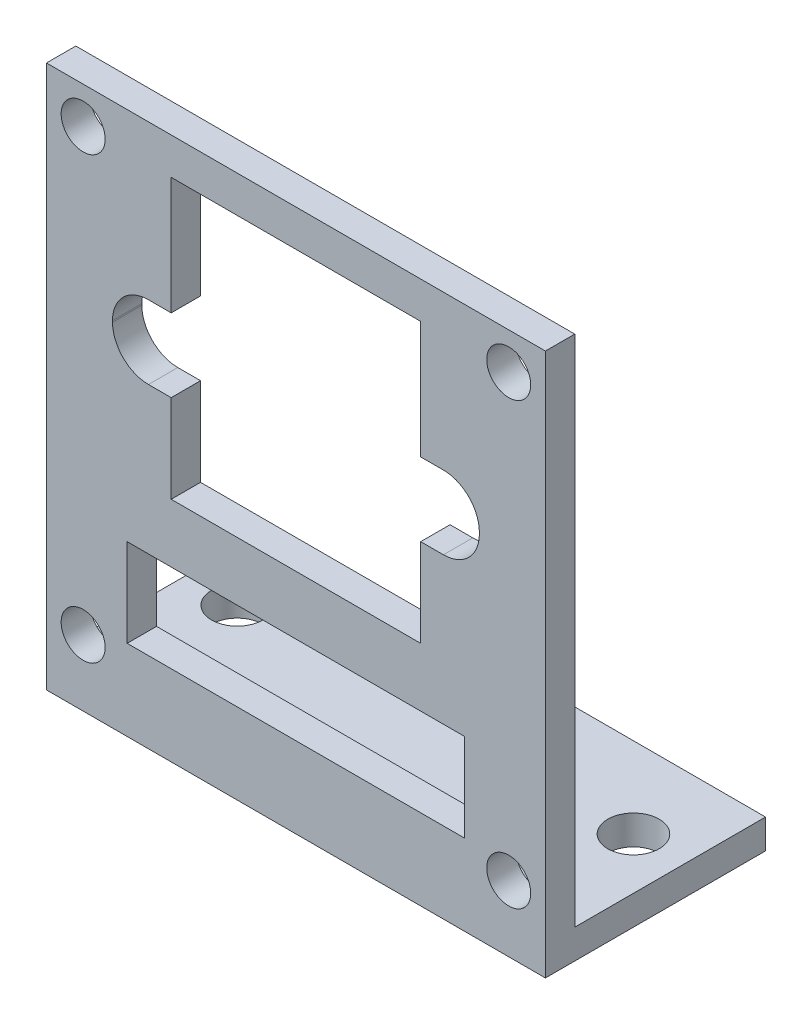
ISO-10303-21;
HEADER;
FILE_DESCRIPTION(('STEP AP214'),'2;1');
FILE_NAME('part.step','',(''),(''),'','','');
FILE_SCHEMA(('AUTOMOTIVE_DESIGN { 1 0 10303 214 1 1 1 1 }'));
ENDSEC;
DATA;
#1=APPLICATION_CONTEXT('core data for automotive mechanical design processes');
#2=APPLICATION_PROTOCOL_DEFINITION('international standard','automotive_design',2000,#1);
#3=PRODUCT_CONTEXT('',#1,'mechanical');
#4=PRODUCT('Part','Part','',(#3));
#5=PRODUCT_RELATED_PRODUCT_CATEGORY('part','',(#4));
#6=PRODUCT_DEFINITION_FORMATION('','',#4);
#7=PRODUCT_DEFINITION_CONTEXT('part definition',#1,'design');
#8=PRODUCT_DEFINITION('design','',#6,#7);
#9=PRODUCT_DEFINITION_SHAPE('','',#8);
#10=(LENGTH_UNIT() NAMED_UNIT(*) SI_UNIT(.MILLI.,.METRE.));
#11=(NAMED_UNIT(*) PLANE_ANGLE_UNIT() SI_UNIT($,.RADIAN.));
#12=(NAMED_UNIT(*) SI_UNIT($,.STERADIAN.) SOLID_ANGLE_UNIT());
#13=UNCERTAINTY_MEASURE_WITH_UNIT(LENGTH_MEASURE(1.E-05),#10,'distance_accuracy_value','');
#14=(GEOMETRIC_REPRESENTATION_CONTEXT(3) GLOBAL_UNCERTAINTY_ASSIGNED_CONTEXT((#13)) GLOBAL_UNIT_ASSIGNED_CONTEXT((#10,
#11,#12)) REPRESENTATION_CONTEXT('',''));
#15=CARTESIAN_POINT('',(0.,0.,0.));
#16=DIRECTION('',(0.,0.,1.));
#17=DIRECTION('',(1.,0.,0.));
#18=AXIS2_PLACEMENT_3D('',#15,#16,#17);
#19=CARTESIAN_POINT('',(0.,0.,2.));
#20=DIRECTION('',(0.,0.,1.));
#21=DIRECTION('',(1.,0.,0.));
#22=AXIS2_PLACEMENT_3D('',#19,#20,#21);
#23=PLANE('',#22);
#24=CARTESIAN_POINT('',(-19.8102928728624,-18.1706781534091,2.));
#25=DIRECTION('',(0.,0.,1.));
#26=DIRECTION('',(1.,0.,0.));
#27=AXIS2_PLACEMENT_3D('',#24,#25,#26);
#28=CIRCLE('',#27,1.5);
#29=CARTESIAN_POINT('',(-18.3102928728624,-18.1706781534091,2.));
#30=VERTEX_POINT('',#29);
#31=EDGE_CURVE('E432',#30,#30,#28,.T.);
#32=ORIENTED_EDGE('',*,*,#31,.F.);
#33=EDGE_LOOP('',(#32));
#34=FACE_BOUND('',#33,.T.);
#35=DIRECTION('',(1.,0.,0.));
#36=VECTOR('',#35,1.);
#37=CARTESIAN_POINT('',(-16.8102928728627,-17.1706781534091,2.));
#38=LINE('',#37,#36);
#39=CARTESIAN_POINT('',(-16.8102928728627,-17.1706781534091,2.));
#40=VERTEX_POINT('',#39);
#41=CARTESIAN_POINT('',(6.18970712713729,-17.1706781534091,2.));
#42=VERTEX_POINT('',#41);
#43=EDGE_CURVE('E451',#40,#42,#38,.T.);
#44=ORIENTED_EDGE('',*,*,#43,.F.);
#45=DIRECTION('',(0.,-1.,0.));
#46=VECTOR('',#45,1.);
#47=CARTESIAN_POINT('',(-16.8102928728627,-11.1706781534091,2.));
#48=LINE('',#47,#46);
#49=CARTESIAN_POINT('',(-16.8102928728627,-11.1706781534091,2.));
#50=VERTEX_POINT('',#49);
#51=EDGE_CURVE('E448',#50,#40,#48,.T.);
#52=ORIENTED_EDGE('',*,*,#51,.F.);
#53=DIRECTION('',(-1.,0.,0.));
#54=VECTOR('',#53,1.);
#55=CARTESIAN_POINT('',(-16.8102928728627,-11.1706781534091,2.));
#56=LINE('',#55,#54);
#57=CARTESIAN_POINT('',(6.18970712713729,-11.1706781534091,2.));
#58=VERTEX_POINT('',#57);
#59=EDGE_CURVE('E459',#58,#50,#56,.T.);
#60=ORIENTED_EDGE('',*,*,#59,.F.);
#61=DIRECTION('',(0.,1.,0.));
#62=VECTOR('',#61,1.);
#63=CARTESIAN_POINT('',(6.18970712713729,-11.1706781534091,2.));
#64=LINE('',#63,#62);
#65=EDGE_CURVE('E455',#42,#58,#64,.T.);
#66=ORIENTED_EDGE('',*,*,#65,.F.);
#67=EDGE_LOOP('',(#44,#52,#60,#66));
#68=FACE_BOUND('',#67,.T.);
#69=CARTESIAN_POINT('',(-19.8102928728627,11.8293218465909,2.));
#70=DIRECTION('',(0.,0.,1.));
#71=DIRECTION('',(1.,0.,0.));
#72=AXIS2_PLACEMENT_3D('',#69,#70,#71);
#73=CIRCLE('',#72,1.5);
#74=CARTESIAN_POINT('',(-18.3102928728627,11.8293218465909,2.));
#75=VERTEX_POINT('',#74);
#76=EDGE_CURVE('E491',#75,#75,#73,.T.);
#77=ORIENTED_EDGE('',*,*,#76,.F.);
#78=EDGE_LOOP('',(#77));
#79=FACE_BOUND('',#78,.T.);
#80=DIRECTION('',(0.,-1.,0.));
#81=VECTOR('',#80,1.);
#82=CARTESIAN_POINT('',(-22.3102928728627,14.3293218465909,2.));
#83=LINE('',#82,#81);
#84=CARTESIAN_POINT('',(-22.3102928728627,14.3293218465909,2.));
#85=VERTEX_POINT('',#84);
#86=CARTESIAN_POINT('',(-22.3102928728627,-22.6706781534091,2.));
#87=VERTEX_POINT('',#86);
#88=EDGE_CURVE('E499',#85,#87,#83,.T.);
#89=ORIENTED_EDGE('',*,*,#88,.T.);
#90=DIRECTION('',(1.,0.,0.));
#91=VECTOR('',#90,1.);
#92=CARTESIAN_POINT('',(-22.3102928728627,-22.6706781534091,2.));
#93=LINE('',#92,#91);
#94=CARTESIAN_POINT('',(11.6897071271373,-22.6706781534091,2.));
#95=VERTEX_POINT('',#94);
#96=EDGE_CURVE('E224',#87,#95,#93,.T.);
#97=ORIENTED_EDGE('',*,*,#96,.T.);
#98=DIRECTION('',(0.,1.,0.));
#99=VECTOR('',#98,1.);
#100=CARTESIAN_POINT('',(11.6897071271373,14.3293218465909,2.));
#101=LINE('',#100,#99);
#102=CARTESIAN_POINT('',(11.6897071271373,14.3293218465909,2.));
#103=VERTEX_POINT('',#102);
#104=EDGE_CURVE('E502',#95,#103,#101,.T.);
#105=ORIENTED_EDGE('',*,*,#104,.T.);
#106=DIRECTION('',(-1.,0.,0.));
#107=VECTOR('',#106,1.);
#108=CARTESIAN_POINT('',(-22.3102928728627,14.3293218465909,2.));
#109=LINE('',#108,#107);
#110=EDGE_CURVE('E506',#103,#85,#109,.T.);
#111=ORIENTED_EDGE('',*,*,#110,.T.);
#112=EDGE_LOOP('',(#89,#97,#105,#111));
#113=FACE_BOUND('',#112,.T.);
#114=CARTESIAN_POINT('',(9.18970712713729,11.8293218465909,2.));
#115=DIRECTION('',(0.,0.,1.));
#116=DIRECTION('',(1.,0.,0.));
#117=AXIS2_PLACEMENT_3D('',#114,#115,#116);
#118=CIRCLE('',#117,1.5);
#119=CARTESIAN_POINT('',(10.6897071271373,11.8293218465909,2.));
#120=VERTEX_POINT('',#119);
#121=EDGE_CURVE('E440',#120,#120,#118,.T.);
#122=ORIENTED_EDGE('',*,*,#121,.F.);
#123=EDGE_LOOP('',(#122));
#124=FACE_BOUND('',#123,.T.);
#125=CARTESIAN_POINT('',(9.1897071271376,-18.1706781534091,2.));
#126=DIRECTION('',(0.,0.,1.));
#127=DIRECTION('',(1.,0.,0.));
#128=AXIS2_PLACEMENT_3D('',#125,#126,#127);
#129=CIRCLE('',#128,1.5);
#130=CARTESIAN_POINT('',(10.6897071271376,-18.1706781534091,2.));
#131=VERTEX_POINT('',#130);
#132=EDGE_CURVE('E424',#131,#131,#129,.T.);
#133=ORIENTED_EDGE('',*,*,#132,.F.);
#134=EDGE_LOOP('',(#133));
#135=FACE_BOUND('',#134,.T.);
#136=DIRECTION('',(-1.,0.,0.));
#137=VECTOR('',#136,1.);
#138=CARTESIAN_POINT('',(-13.8102928728627,3.82932184659091,2.));
#139=LINE('',#138,#137);
#140=CARTESIAN_POINT('',(-13.8102928728627,3.82932184659091,2.));
#141=VERTEX_POINT('',#140);
#142=CARTESIAN_POINT('',(-15.3602928728627,3.82932184659091,2.));
#143=VERTEX_POINT('',#142);
#144=EDGE_CURVE('E269',#141,#143,#139,.T.);
#145=ORIENTED_EDGE('',*,*,#144,.F.);
#146=DIRECTION('',(0.,-1.,0.));
#147=VECTOR('',#146,1.);
#148=CARTESIAN_POINT('',(-13.8102928728627,11.8293218465909,2.));
#149=LINE('',#148,#147);
#150=CARTESIAN_POINT('',(-13.8102928728627,11.8293218465909,2.));
#151=VERTEX_POINT('',#150);
#152=EDGE_CURVE('E266',#151,#141,#149,.T.);
#153=ORIENTED_EDGE('',*,*,#152,.F.);
#154=DIRECTION('',(-1.,0.,0.));
#155=VECTOR('',#154,1.);
#156=CARTESIAN_POINT('',(-13.8102928728627,11.8293218465909,2.));
#157=LINE('',#156,#155);
#158=CARTESIAN_POINT('',(3.1897071271373,11.8293218465909,2.));
#159=VERTEX_POINT('',#158);
#160=EDGE_CURVE('E312',#159,#151,#157,.T.);
#161=ORIENTED_EDGE('',*,*,#160,.F.);
#162=DIRECTION('',(0.,1.,0.));
#163=VECTOR('',#162,1.);
#164=CARTESIAN_POINT('',(3.1897071271373,11.8293218465909,2.));
#165=LINE('',#164,#163);
#166=CARTESIAN_POINT('',(3.1897071271373,3.82932184659091,2.));
#167=VERTEX_POINT('',#166);
#168=EDGE_CURVE('E309',#167,#159,#165,.T.);
#169=ORIENTED_EDGE('',*,*,#168,.F.);
#170=DIRECTION('',(-1.,0.,0.));
#171=VECTOR('',#170,1.);
#172=CARTESIAN_POINT('',(3.1897071271373,3.82932184659091,2.));
#173=LINE('',#172,#171);
#174=CARTESIAN_POINT('',(4.73970712713728,3.82932184659091,2.));
#175=VERTEX_POINT('',#174);
#176=EDGE_CURVE('E306',#175,#167,#173,.T.);
#177=ORIENTED_EDGE('',*,*,#176,.F.);
#178=CARTESIAN_POINT('',(4.7397071271373,1.37932184659091,2.));
#179=DIRECTION('',(0.,0.,1.));
#180=DIRECTION('',(-1.,0.,0.));
#181=AXIS2_PLACEMENT_3D('',#178,#179,#180);
#182=CIRCLE('',#181,2.45);
#183=CARTESIAN_POINT('',(7.1897071271373,1.37932184659089,2.));
#184=VERTEX_POINT('',#183);
#185=EDGE_CURVE('E303',#184,#175,#182,.T.);
#186=ORIENTED_EDGE('',*,*,#185,.F.);
#187=DIRECTION('',(0.,1.,0.));
#188=VECTOR('',#187,1.);
#189=CARTESIAN_POINT('',(7.1897071271373,1.37932184659089,2.));
#190=LINE('',#189,#188);
#191=CARTESIAN_POINT('',(7.1897071271373,1.27932184659093,2.));
#192=VERTEX_POINT('',#191);
#193=EDGE_CURVE('E300',#192,#184,#190,.T.);
#194=ORIENTED_EDGE('',*,*,#193,.F.);
#195=CARTESIAN_POINT('',(4.7397071271373,1.27932184659091,2.));
#196=DIRECTION('',(0.,0.,1.));
#197=DIRECTION('',(1.,0.,0.));
#198=AXIS2_PLACEMENT_3D('',#195,#196,#197);
#199=CIRCLE('',#198,2.45);
#200=CARTESIAN_POINT('',(4.73970712713728,-1.17067815340909,2.));
#201=VERTEX_POINT('',#200);
#202=EDGE_CURVE('E297',#201,#192,#199,.T.);
#203=ORIENTED_EDGE('',*,*,#202,.F.);
#204=DIRECTION('',(1.,0.,0.));
#205=VECTOR('',#204,1.);
#206=CARTESIAN_POINT('',(3.1897071271373,-1.17067815340909,2.));
#207=LINE('',#206,#205);
#208=CARTESIAN_POINT('',(3.1897071271373,-1.17067815340909,2.));
#209=VERTEX_POINT('',#208);
#210=EDGE_CURVE('E294',#209,#201,#207,.T.);
#211=ORIENTED_EDGE('',*,*,#210,.F.);
#212=DIRECTION('',(0.,1.,0.));
#213=VECTOR('',#212,1.);
#214=CARTESIAN_POINT('',(3.1897071271373,-1.17067815340909,2.));
#215=LINE('',#214,#213);
#216=CARTESIAN_POINT('',(3.1897071271373,-7.17067815340909,2.));
#217=VERTEX_POINT('',#216);
#218=EDGE_CURVE('E291',#217,#209,#215,.T.);
#219=ORIENTED_EDGE('',*,*,#218,.F.);
#220=DIRECTION('',(1.,0.,0.));
#221=VECTOR('',#220,1.);
#222=CARTESIAN_POINT('',(-13.8102928728627,-7.17067815340909,2.));
#223=LINE('',#222,#221);
#224=CARTESIAN_POINT('',(-13.8102928728627,-7.17067815340909,2.));
#225=VERTEX_POINT('',#224);
#226=EDGE_CURVE('E288',#225,#217,#223,.T.);
#227=ORIENTED_EDGE('',*,*,#226,.F.);
#228=DIRECTION('',(0.,-1.,0.));
#229=VECTOR('',#228,1.);
#230=CARTESIAN_POINT('',(-13.8102928728627,-1.17067815340909,2.));
#231=LINE('',#230,#229);
#232=CARTESIAN_POINT('',(-13.8102928728627,-1.17067815340909,2.));
#233=VERTEX_POINT('',#232);
#234=EDGE_CURVE('E285',#233,#225,#231,.T.);
#235=ORIENTED_EDGE('',*,*,#234,.F.);
#236=DIRECTION('',(1.,0.,0.));
#237=VECTOR('',#236,1.);
#238=CARTESIAN_POINT('',(-13.8102928728627,-1.17067815340909,2.));
#239=LINE('',#238,#237);
#240=CARTESIAN_POINT('',(-15.3602928728627,-1.17067815340909,2.));
#241=VERTEX_POINT('',#240);
#242=EDGE_CURVE('E282',#241,#233,#239,.T.);
#243=ORIENTED_EDGE('',*,*,#242,.F.);
#244=CARTESIAN_POINT('',(-15.3602928728627,1.27932184659091,2.));
#245=DIRECTION('',(0.,0.,1.));
#246=DIRECTION('',(-1.,0.,0.));
#247=AXIS2_PLACEMENT_3D('',#244,#245,#246);
#248=CIRCLE('',#247,2.45);
#249=CARTESIAN_POINT('',(-17.8102928728627,1.27932184659091,2.));
#250=VERTEX_POINT('',#249);
#251=EDGE_CURVE('E279',#250,#241,#248,.T.);
#252=ORIENTED_EDGE('',*,*,#251,.F.);
#253=DIRECTION('',(0.,-1.,0.));
#254=VECTOR('',#253,1.);
#255=CARTESIAN_POINT('',(-17.8102928728627,1.3793218465909,2.));
#256=LINE('',#255,#254);
#257=CARTESIAN_POINT('',(-17.8102928728627,1.3793218465909,2.));
#258=VERTEX_POINT('',#257);
#259=EDGE_CURVE('E276',#258,#250,#256,.T.);
#260=ORIENTED_EDGE('',*,*,#259,.F.);
#261=CARTESIAN_POINT('',(-15.3602928728627,1.37932184659091,2.));
#262=DIRECTION('',(0.,0.,1.));
#263=DIRECTION('',(1.,0.,0.));
#264=AXIS2_PLACEMENT_3D('',#261,#262,#263);
#265=CIRCLE('',#264,2.45);
#266=EDGE_CURVE('E273',#143,#258,#265,.T.);
#267=ORIENTED_EDGE('',*,*,#266,.F.);
#268=EDGE_LOOP('',(#145,#153,#161,#169,#177,#186,#194,#203,#211,#219,#227,#235,#243,#252,#260,#267));
#269=FACE_BOUND('',#268,.T.);
#270=ADVANCED_FACE('F39',(#34,#68,#79,#113,#124,#135,#269),#23,.T.);
#271=CARTESIAN_POINT('',(0.,0.,0.));
#272=DIRECTION('',(0.,0.,1.));
#273=DIRECTION('',(1.,0.,0.));
#274=AXIS2_PLACEMENT_3D('',#271,#272,#273);
#275=PLANE('',#274);
#276=CARTESIAN_POINT('',(9.1897071271376,-18.1706781534091,0.));
#277=DIRECTION('',(0.,0.,1.));
#278=DIRECTION('',(1.,0.,0.));
#279=AXIS2_PLACEMENT_3D('',#276,#277,#278);
#280=CIRCLE('',#279,1.5);
#281=CARTESIAN_POINT('',(10.6897071271376,-18.1706781534091,0.));
#282=VERTEX_POINT('',#281);
#283=EDGE_CURVE('E423',#282,#282,#280,.T.);
#284=ORIENTED_EDGE('',*,*,#283,.T.);
#285=EDGE_LOOP('',(#284));
#286=FACE_BOUND('',#285,.T.);
#287=CARTESIAN_POINT('',(-19.8102928728624,-18.1706781534091,0.));
#288=DIRECTION('',(0.,0.,1.));
#289=DIRECTION('',(1.,0.,0.));
#290=AXIS2_PLACEMENT_3D('',#287,#288,#289);
#291=CIRCLE('',#290,1.5);
#292=CARTESIAN_POINT('',(-18.3102928728624,-18.1706781534091,0.));
#293=VERTEX_POINT('',#292);
#294=EDGE_CURVE('E428',#293,#293,#291,.T.);
#295=ORIENTED_EDGE('',*,*,#294,.T.);
#296=EDGE_LOOP('',(#295));
#297=FACE_BOUND('',#296,.T.);
#298=CARTESIAN_POINT('',(9.18970712713729,11.8293218465909,0.));
#299=DIRECTION('',(0.,0.,1.));
#300=DIRECTION('',(1.,0.,0.));
#301=AXIS2_PLACEMENT_3D('',#298,#299,#300);
#302=CIRCLE('',#301,1.5);
#303=CARTESIAN_POINT('',(10.6897071271373,11.8293218465909,0.));
#304=VERTEX_POINT('',#303);
#305=EDGE_CURVE('E436',#304,#304,#302,.T.);
#306=ORIENTED_EDGE('',*,*,#305,.T.);
#307=EDGE_LOOP('',(#306));
#308=FACE_BOUND('',#307,.T.);
#309=DIRECTION('',(0.,-1.,0.));
#310=VECTOR('',#309,1.);
#311=CARTESIAN_POINT('',(-16.8102928728627,-11.1706781534091,0.));
#312=LINE('',#311,#310);
#313=CARTESIAN_POINT('',(-16.8102928728627,-11.1706781534091,0.));
#314=VERTEX_POINT('',#313);
#315=CARTESIAN_POINT('',(-16.8102928728627,-17.1706781534091,0.));
#316=VERTEX_POINT('',#315);
#317=EDGE_CURVE('E444',#314,#316,#312,.T.);
#318=ORIENTED_EDGE('',*,*,#317,.T.);
#319=DIRECTION('',(1.,0.,0.));
#320=VECTOR('',#319,1.);
#321=CARTESIAN_POINT('',(-16.8102928728627,-17.1706781534091,0.));
#322=LINE('',#321,#320);
#323=CARTESIAN_POINT('',(6.18970712713729,-17.1706781534091,0.));
#324=VERTEX_POINT('',#323);
#325=EDGE_CURVE('E466',#316,#324,#322,.T.);
#326=ORIENTED_EDGE('',*,*,#325,.T.);
#327=DIRECTION('',(0.,1.,0.));
#328=VECTOR('',#327,1.);
#329=CARTESIAN_POINT('',(6.18970712713729,-11.1706781534091,0.));
#330=LINE('',#329,#328);
#331=CARTESIAN_POINT('',(6.18970712713729,-11.1706781534091,0.));
#332=VERTEX_POINT('',#331);
#333=EDGE_CURVE('E470',#324,#332,#330,.T.);
#334=ORIENTED_EDGE('',*,*,#333,.T.);
#335=DIRECTION('',(-1.,0.,0.));
#336=VECTOR('',#335,1.);
#337=CARTESIAN_POINT('',(-16.8102928728627,-11.1706781534091,0.));
#338=LINE('',#337,#336);
#339=EDGE_CURVE('E452',#332,#314,#338,.T.);
#340=ORIENTED_EDGE('',*,*,#339,.T.);
#341=EDGE_LOOP('',(#318,#326,#334,#340));
#342=FACE_BOUND('',#341,.T.);
#343=DIRECTION('',(0.,-1.,0.));
#344=VECTOR('',#343,1.);
#345=CARTESIAN_POINT('',(-22.3102928728627,14.3293218465909,0.));
#346=LINE('',#345,#344);
#347=CARTESIAN_POINT('',(-22.3102928728627,14.3293218465909,0.));
#348=VERTEX_POINT('',#347);
#349=CARTESIAN_POINT('',(-22.3102928728627,-20.6706781534091,0.));
#350=VERTEX_POINT('',#349);
#351=EDGE_CURVE('E495',#348,#350,#346,.T.);
#352=ORIENTED_EDGE('',*,*,#351,.F.);
#353=DIRECTION('',(-1.,0.,0.));
#354=VECTOR('',#353,1.);
#355=CARTESIAN_POINT('',(-22.3102928728627,14.3293218465909,0.));
#356=LINE('',#355,#354);
#357=CARTESIAN_POINT('',(11.6897071271373,14.3293218465909,0.));
#358=VERTEX_POINT('',#357);
#359=EDGE_CURVE('E503',#358,#348,#356,.T.);
#360=ORIENTED_EDGE('',*,*,#359,.F.);
#361=DIRECTION('',(0.,1.,0.));
#362=VECTOR('',#361,1.);
#363=CARTESIAN_POINT('',(11.6897071271373,14.3293218465909,0.));
#364=LINE('',#363,#362);
#365=CARTESIAN_POINT('',(11.6897071271373,-20.6706781534091,0.));
#366=VERTEX_POINT('',#365);
#367=EDGE_CURVE('E515',#366,#358,#364,.T.);
#368=ORIENTED_EDGE('',*,*,#367,.F.);
#369=DIRECTION('',(1.,0.,0.));
#370=VECTOR('',#369,1.);
#371=CARTESIAN_POINT('',(-22.3102928728627,-20.6706781534091,0.));
#372=LINE('',#371,#370);
#373=EDGE_CURVE('E511',#350,#366,#372,.T.);
#374=ORIENTED_EDGE('',*,*,#373,.F.);
#375=EDGE_LOOP('',(#352,#360,#368,#374));
#376=FACE_BOUND('',#375,.T.);
#377=CARTESIAN_POINT('',(-19.8102928728627,11.8293218465909,0.));
#378=DIRECTION('',(0.,0.,1.));
#379=DIRECTION('',(1.,0.,0.));
#380=AXIS2_PLACEMENT_3D('',#377,#378,#379);
#381=CIRCLE('',#380,1.5);
#382=CARTESIAN_POINT('',(-18.3102928728627,11.8293218465909,0.));
#383=VERTEX_POINT('',#382);
#384=EDGE_CURVE('E490',#383,#383,#381,.T.);
#385=ORIENTED_EDGE('',*,*,#384,.T.);
#386=EDGE_LOOP('',(#385));
#387=FACE_BOUND('',#386,.T.);
#388=DIRECTION('',(0.,-1.,0.));
#389=VECTOR('',#388,1.);
#390=CARTESIAN_POINT('',(-13.8102928728627,11.8293218465909,0.));
#391=LINE('',#390,#389);
#392=CARTESIAN_POINT('',(-13.8102928728627,11.8293218465909,0.));
#393=VERTEX_POINT('',#392);
#394=CARTESIAN_POINT('',(-13.8102928728627,3.82932184659091,0.));
#395=VERTEX_POINT('',#394);
#396=EDGE_CURVE('E65',#393,#395,#391,.T.);
#397=ORIENTED_EDGE('',*,*,#396,.T.);
#398=DIRECTION('',(-1.,0.,0.));
#399=VECTOR('',#398,1.);
#400=CARTESIAN_POINT('',(-13.8102928728627,3.82932184659091,0.));
#401=LINE('',#400,#399);
#402=CARTESIAN_POINT('',(-15.3602928728627,3.82932184659091,0.));
#403=VERTEX_POINT('',#402);
#404=EDGE_CURVE('E318',#395,#403,#401,.T.);
#405=ORIENTED_EDGE('',*,*,#404,.T.);
#406=CARTESIAN_POINT('',(-15.3602928728627,1.37932184659091,0.));
#407=DIRECTION('',(0.,0.,1.));
#408=DIRECTION('',(1.,0.,0.));
#409=AXIS2_PLACEMENT_3D('',#406,#407,#408);
#410=CIRCLE('',#409,2.45);
#411=CARTESIAN_POINT('',(-17.8102928728627,1.3793218465909,0.));
#412=VERTEX_POINT('',#411);
#413=EDGE_CURVE('E322',#403,#412,#410,.T.);
#414=ORIENTED_EDGE('',*,*,#413,.T.);
#415=DIRECTION('',(0.,-1.,0.));
#416=VECTOR('',#415,1.);
#417=CARTESIAN_POINT('',(-17.8102928728627,1.3793218465909,0.));
#418=LINE('',#417,#416);
#419=CARTESIAN_POINT('',(-17.8102928728627,1.27932184659091,0.));
#420=VERTEX_POINT('',#419);
#421=EDGE_CURVE('E326',#412,#420,#418,.T.);
#422=ORIENTED_EDGE('',*,*,#421,.T.);
#423=CARTESIAN_POINT('',(-15.3602928728627,1.27932184659091,0.));
#424=DIRECTION('',(0.,0.,1.));
#425=DIRECTION('',(-1.,0.,0.));
#426=AXIS2_PLACEMENT_3D('',#423,#424,#425);
#427=CIRCLE('',#426,2.45);
#428=CARTESIAN_POINT('',(-15.3602928728627,-1.17067815340909,0.));
#429=VERTEX_POINT('',#428);
#430=EDGE_CURVE('E330',#420,#429,#427,.T.);
#431=ORIENTED_EDGE('',*,*,#430,.T.);
#432=DIRECTION('',(1.,0.,0.));
#433=VECTOR('',#432,1.);
#434=CARTESIAN_POINT('',(-13.8102928728627,-1.17067815340909,0.));
#435=LINE('',#434,#433);
#436=CARTESIAN_POINT('',(-13.8102928728627,-1.17067815340909,0.));
#437=VERTEX_POINT('',#436);
#438=EDGE_CURVE('E334',#429,#437,#435,.T.);
#439=ORIENTED_EDGE('',*,*,#438,.T.);
#440=DIRECTION('',(0.,-1.,0.));
#441=VECTOR('',#440,1.);
#442=CARTESIAN_POINT('',(-13.8102928728627,-1.17067815340909,0.));
#443=LINE('',#442,#441);
#444=CARTESIAN_POINT('',(-13.8102928728627,-7.17067815340909,0.));
#445=VERTEX_POINT('',#444);
#446=EDGE_CURVE('E338',#437,#445,#443,.T.);
#447=ORIENTED_EDGE('',*,*,#446,.T.);
#448=DIRECTION('',(1.,0.,0.));
#449=VECTOR('',#448,1.);
#450=CARTESIAN_POINT('',(-13.8102928728627,-7.17067815340909,0.));
#451=LINE('',#450,#449);
#452=CARTESIAN_POINT('',(3.1897071271373,-7.17067815340909,0.));
#453=VERTEX_POINT('',#452);
#454=EDGE_CURVE('E342',#445,#453,#451,.T.);
#455=ORIENTED_EDGE('',*,*,#454,.T.);
#456=DIRECTION('',(0.,1.,0.));
#457=VECTOR('',#456,1.);
#458=CARTESIAN_POINT('',(3.1897071271373,-1.17067815340909,0.));
#459=LINE('',#458,#457);
#460=CARTESIAN_POINT('',(3.1897071271373,-1.17067815340909,0.));
#461=VERTEX_POINT('',#460);
#462=EDGE_CURVE('E346',#453,#461,#459,.T.);
#463=ORIENTED_EDGE('',*,*,#462,.T.);
#464=DIRECTION('',(1.,0.,0.));
#465=VECTOR('',#464,1.);
#466=CARTESIAN_POINT('',(3.1897071271373,-1.17067815340909,0.));
#467=LINE('',#466,#465);
#468=CARTESIAN_POINT('',(4.73970712713728,-1.17067815340909,0.));
#469=VERTEX_POINT('',#468);
#470=EDGE_CURVE('E350',#461,#469,#467,.T.);
#471=ORIENTED_EDGE('',*,*,#470,.T.);
#472=CARTESIAN_POINT('',(4.7397071271373,1.27932184659091,0.));
#473=DIRECTION('',(0.,0.,1.));
#474=DIRECTION('',(1.,0.,0.));
#475=AXIS2_PLACEMENT_3D('',#472,#473,#474);
#476=CIRCLE('',#475,2.45);
#477=CARTESIAN_POINT('',(7.1897071271373,1.27932184659093,0.));
#478=VERTEX_POINT('',#477);
#479=EDGE_CURVE('E354',#469,#478,#476,.T.);
#480=ORIENTED_EDGE('',*,*,#479,.T.);
#481=DIRECTION('',(0.,1.,0.));
#482=VECTOR('',#481,1.);
#483=CARTESIAN_POINT('',(7.1897071271373,1.37932184659089,0.));
#484=LINE('',#483,#482);
#485=CARTESIAN_POINT('',(7.1897071271373,1.37932184659089,0.));
#486=VERTEX_POINT('',#485);
#487=EDGE_CURVE('E358',#478,#486,#484,.T.);
#488=ORIENTED_EDGE('',*,*,#487,.T.);
#489=CARTESIAN_POINT('',(4.7397071271373,1.37932184659091,0.));
#490=DIRECTION('',(0.,0.,1.));
#491=DIRECTION('',(-1.,0.,0.));
#492=AXIS2_PLACEMENT_3D('',#489,#490,#491);
#493=CIRCLE('',#492,2.45);
#494=CARTESIAN_POINT('',(4.73970712713728,3.82932184659091,0.));
#495=VERTEX_POINT('',#494);
#496=EDGE_CURVE('E362',#486,#495,#493,.T.);
#497=ORIENTED_EDGE('',*,*,#496,.T.);
#498=DIRECTION('',(-1.,0.,0.));
#499=VECTOR('',#498,1.);
#500=CARTESIAN_POINT('',(3.1897071271373,3.82932184659091,0.));
#501=LINE('',#500,#499);
#502=CARTESIAN_POINT('',(3.1897071271373,3.82932184659091,0.));
#503=VERTEX_POINT('',#502);
#504=EDGE_CURVE('E366',#495,#503,#501,.T.);
#505=ORIENTED_EDGE('',*,*,#504,.T.);
#506=DIRECTION('',(0.,1.,0.));
#507=VECTOR('',#506,1.);
#508=CARTESIAN_POINT('',(3.1897071271373,11.8293218465909,0.));
#509=LINE('',#508,#507);
#510=CARTESIAN_POINT('',(3.1897071271373,11.8293218465909,0.));
#511=VERTEX_POINT('',#510);
#512=EDGE_CURVE('E370',#503,#511,#509,.T.);
#513=ORIENTED_EDGE('',*,*,#512,.T.);
#514=DIRECTION('',(-1.,0.,0.));
#515=VECTOR('',#514,1.);
#516=CARTESIAN_POINT('',(-13.8102928728627,11.8293218465909,0.));
#517=LINE('',#516,#515);
#518=EDGE_CURVE('E270',#511,#393,#517,.T.);
#519=ORIENTED_EDGE('',*,*,#518,.T.);
#520=EDGE_LOOP('',(#397,#405,#414,#422,#431,#439,#447,#455,#463,#471,#480,#488,#497,#505,#513,#519));
#521=FACE_BOUND('',#520,.T.);
#522=ADVANCED_FACE('F557',(#286,#297,#308,#342,#376,#387,#521),#275,.F.);
#523=CARTESIAN_POINT('',(-22.3102928728627,14.3293218465909,2.));
#524=DIRECTION('',(1.,0.,0.));
#525=DIRECTION('',(0.,1.,0.));
#526=AXIS2_PLACEMENT_3D('',#523,#524,#525);
#527=PLANE('',#526);
#528=ORIENTED_EDGE('',*,*,#351,.T.);
#529=DIRECTION('',(0.,0.,1.));
#530=VECTOR('',#529,1.);
#531=CARTESIAN_POINT('',(-22.3102928728627,-20.6706781534091,-13.));
#532=LINE('',#531,#530);
#533=CARTESIAN_POINT('',(-22.3102928728627,-20.6706781534091,-13.));
#534=VERTEX_POINT('',#533);
#535=EDGE_CURVE('E245',#534,#350,#532,.T.);
#536=ORIENTED_EDGE('',*,*,#535,.F.);
#537=DIRECTION('',(0.,-1.,0.));
#538=VECTOR('',#537,1.);
#539=CARTESIAN_POINT('',(-22.3102928728627,-20.6706781534091,-13.));
#540=LINE('',#539,#538);
#541=CARTESIAN_POINT('',(-22.3102928728627,-22.6706781534091,-13.));
#542=VERTEX_POINT('',#541);
#543=EDGE_CURVE('E237',#534,#542,#540,.T.);
#544=ORIENTED_EDGE('',*,*,#543,.T.);
#545=DIRECTION('',(0.,0.,1.));
#546=VECTOR('',#545,1.);
#547=CARTESIAN_POINT('',(-22.3102928728627,-22.6706781534091,-13.));
#548=LINE('',#547,#546);
#549=EDGE_CURVE('E218',#542,#87,#548,.T.);
#550=ORIENTED_EDGE('',*,*,#549,.T.);
#551=ORIENTED_EDGE('',*,*,#88,.F.);
#552=DIRECTION('',(0.,0.,-1.));
#553=VECTOR('',#552,1.);
#554=CARTESIAN_POINT('',(-22.3102928728627,14.3293218465909,2.));
#555=LINE('',#554,#553);
#556=EDGE_CURVE('E49',#85,#348,#555,.T.);
#557=ORIENTED_EDGE('',*,*,#556,.T.);
#558=EDGE_LOOP('',(#528,#536,#544,#550,#551,#557));
#559=FACE_BOUND('',#558,.T.);
#560=ADVANCED_FACE('F41',(#559),#527,.F.);
#561=CARTESIAN_POINT('',(11.6897071271373,14.3293218465909,2.));
#562=DIRECTION('',(-1.,0.,0.));
#563=DIRECTION('',(0.,-1.,0.));
#564=AXIS2_PLACEMENT_3D('',#561,#562,#563);
#565=PLANE('',#564);
#566=ORIENTED_EDGE('',*,*,#367,.T.);
#567=DIRECTION('',(0.,0.,-1.));
#568=VECTOR('',#567,1.);
#569=CARTESIAN_POINT('',(11.6897071271373,14.3293218465909,2.));
#570=LINE('',#569,#568);
#571=EDGE_CURVE('E11',#103,#358,#570,.T.);
#572=ORIENTED_EDGE('',*,*,#571,.F.);
#573=ORIENTED_EDGE('',*,*,#104,.F.);
#574=DIRECTION('',(0.,0.,1.));
#575=VECTOR('',#574,1.);
#576=CARTESIAN_POINT('',(11.6897071271373,-22.6706781534091,-13.));
#577=LINE('',#576,#575);
#578=CARTESIAN_POINT('',(11.6897071271373,-22.6706781534091,-13.));
#579=VERTEX_POINT('',#578);
#580=EDGE_CURVE('E229',#579,#95,#577,.T.);
#581=ORIENTED_EDGE('',*,*,#580,.F.);
#582=DIRECTION('',(0.,1.,0.));
#583=VECTOR('',#582,1.);
#584=CARTESIAN_POINT('',(11.6897071271373,-20.6706781534091,-13.));
#585=LINE('',#584,#583);
#586=CARTESIAN_POINT('',(11.6897071271373,-20.6706781534091,-13.));
#587=VERTEX_POINT('',#586);
#588=EDGE_CURVE('E240',#579,#587,#585,.T.);
#589=ORIENTED_EDGE('',*,*,#588,.T.);
#590=DIRECTION('',(0.,0.,1.));
#591=VECTOR('',#590,1.);
#592=CARTESIAN_POINT('',(11.6897071271373,-20.6706781534091,-13.));
#593=LINE('',#592,#591);
#594=EDGE_CURVE('E260',#587,#366,#593,.T.);
#595=ORIENTED_EDGE('',*,*,#594,.T.);
#596=EDGE_LOOP('',(#566,#572,#573,#581,#589,#595));
#597=FACE_BOUND('',#596,.T.);
#598=ADVANCED_FACE('F547',(#597),#565,.F.);
#599=CARTESIAN_POINT('',(-22.3102928728627,14.3293218465909,2.));
#600=DIRECTION('',(0.,-1.,0.));
#601=DIRECTION('',(0.,0.,-1.));
#602=AXIS2_PLACEMENT_3D('',#599,#600,#601);
#603=PLANE('',#602);
#604=ORIENTED_EDGE('',*,*,#359,.T.);
#605=ORIENTED_EDGE('',*,*,#556,.F.);
#606=ORIENTED_EDGE('',*,*,#110,.F.);
#607=ORIENTED_EDGE('',*,*,#571,.T.);
#608=EDGE_LOOP('',(#604,#605,#606,#607));
#609=FACE_BOUND('',#608,.T.);
#610=ADVANCED_FACE('F559',(#609),#603,.F.);
#611=CARTESIAN_POINT('',(-19.8102928728627,11.8293218465909,2.));
#612=DIRECTION('',(0.,0.,-1.));
#613=DIRECTION('',(-1.,0.,0.));
#614=AXIS2_PLACEMENT_3D('',#611,#612,#613);
#615=CYLINDRICAL_SURFACE('',#614,1.5);
#616=ORIENTED_EDGE('',*,*,#76,.T.);
#617=EDGE_LOOP('',(#616));
#618=FACE_BOUND('',#617,.T.);
#619=ORIENTED_EDGE('',*,*,#384,.F.);
#620=EDGE_LOOP('',(#619));
#621=FACE_BOUND('',#620,.T.);
#622=ADVANCED_FACE('F561',(#618,#621),#615,.F.);
#623=CARTESIAN_POINT('',(-16.8102928728627,-11.1706781534091,2.));
#624=DIRECTION('',(1.,0.,0.));
#625=DIRECTION('',(0.,0.,-1.));
#626=AXIS2_PLACEMENT_3D('',#623,#624,#625);
#627=PLANE('',#626);
#628=ORIENTED_EDGE('',*,*,#317,.F.);
#629=DIRECTION('',(0.,0.,-1.));
#630=VECTOR('',#629,1.);
#631=CARTESIAN_POINT('',(-16.8102928728627,-11.1706781534091,2.));
#632=LINE('',#631,#630);
#633=EDGE_CURVE('E462',#50,#314,#632,.T.);
#634=ORIENTED_EDGE('',*,*,#633,.F.);
#635=ORIENTED_EDGE('',*,*,#51,.T.);
#636=DIRECTION('',(0.,0.,-1.));
#637=VECTOR('',#636,1.);
#638=CARTESIAN_POINT('',(-16.8102928728627,-17.1706781534091,2.));
#639=LINE('',#638,#637);
#640=EDGE_CURVE('E486',#40,#316,#639,.T.);
#641=ORIENTED_EDGE('',*,*,#640,.T.);
#642=EDGE_LOOP('',(#628,#634,#635,#641));
#643=FACE_BOUND('',#642,.T.);
#644=ADVANCED_FACE('F567',(#643),#627,.T.);
#645=CARTESIAN_POINT('',(-16.8102928728627,-17.1706781534091,2.));
#646=DIRECTION('',(0.,1.,0.));
#647=DIRECTION('',(0.,0.,1.));
#648=AXIS2_PLACEMENT_3D('',#645,#646,#647);
#649=PLANE('',#648);
#650=ORIENTED_EDGE('',*,*,#325,.F.);
#651=ORIENTED_EDGE('',*,*,#640,.F.);
#652=ORIENTED_EDGE('',*,*,#43,.T.);
#653=DIRECTION('',(0.,0.,-1.));
#654=VECTOR('',#653,1.);
#655=CARTESIAN_POINT('',(6.18970712713729,-17.1706781534091,2.));
#656=LINE('',#655,#654);
#657=EDGE_CURVE('E483',#42,#324,#656,.T.);
#658=ORIENTED_EDGE('',*,*,#657,.T.);
#659=EDGE_LOOP('',(#650,#651,#652,#658));
#660=FACE_BOUND('',#659,.T.);
#661=ADVANCED_FACE('F583',(#660),#649,.T.);
#662=CARTESIAN_POINT('',(6.18970712713729,-11.1706781534091,2.));
#663=DIRECTION('',(-1.,0.,0.));
#664=DIRECTION('',(0.,-1.,0.));
#665=AXIS2_PLACEMENT_3D('',#662,#663,#664);
#666=PLANE('',#665);
#667=ORIENTED_EDGE('',*,*,#333,.F.);
#668=ORIENTED_EDGE('',*,*,#657,.F.);
#669=ORIENTED_EDGE('',*,*,#65,.T.);
#670=DIRECTION('',(0.,0.,-1.));
#671=VECTOR('',#670,1.);
#672=CARTESIAN_POINT('',(6.18970712713729,-11.1706781534091,2.));
#673=LINE('',#672,#671);
#674=EDGE_CURVE('E480',#58,#332,#673,.T.);
#675=ORIENTED_EDGE('',*,*,#674,.T.);
#676=EDGE_LOOP('',(#667,#668,#669,#675));
#677=FACE_BOUND('',#676,.T.);
#678=ADVANCED_FACE('F587',(#677),#666,.T.);
#679=CARTESIAN_POINT('',(-16.8102928728627,-11.1706781534091,2.));
#680=DIRECTION('',(0.,-1.,0.));
#681=DIRECTION('',(0.,0.,-1.));
#682=AXIS2_PLACEMENT_3D('',#679,#680,#681);
#683=PLANE('',#682);
#684=ORIENTED_EDGE('',*,*,#339,.F.);
#685=ORIENTED_EDGE('',*,*,#674,.F.);
#686=ORIENTED_EDGE('',*,*,#59,.T.);
#687=ORIENTED_EDGE('',*,*,#633,.T.);
#688=EDGE_LOOP('',(#684,#685,#686,#687));
#689=FACE_BOUND('',#688,.T.);
#690=ADVANCED_FACE('F591',(#689),#683,.T.);
#691=CARTESIAN_POINT('',(9.18970712713729,11.8293218465909,2.));
#692=DIRECTION('',(0.,0.,-1.));
#693=DIRECTION('',(-1.,0.,0.));
#694=AXIS2_PLACEMENT_3D('',#691,#692,#693);
#695=CYLINDRICAL_SURFACE('',#694,1.5);
#696=ORIENTED_EDGE('',*,*,#121,.T.);
#697=EDGE_LOOP('',(#696));
#698=FACE_BOUND('',#697,.T.);
#699=ORIENTED_EDGE('',*,*,#305,.F.);
#700=EDGE_LOOP('',(#699));
#701=FACE_BOUND('',#700,.T.);
#702=ADVANCED_FACE('F595',(#698,#701),#695,.F.);
#703=CARTESIAN_POINT('',(-19.8102928728624,-18.1706781534091,2.));
#704=DIRECTION('',(0.,0.,-1.));
#705=DIRECTION('',(-1.,0.,0.));
#706=AXIS2_PLACEMENT_3D('',#703,#704,#705);
#707=CYLINDRICAL_SURFACE('',#706,1.5);
#708=ORIENTED_EDGE('',*,*,#31,.T.);
#709=EDGE_LOOP('',(#708));
#710=FACE_BOUND('',#709,.T.);
#711=ORIENTED_EDGE('',*,*,#294,.F.);
#712=EDGE_LOOP('',(#711));
#713=FACE_BOUND('',#712,.T.);
#714=ADVANCED_FACE('F599',(#710,#713),#707,.F.);
#715=CARTESIAN_POINT('',(9.1897071271376,-18.1706781534091,2.));
#716=DIRECTION('',(0.,0.,-1.));
#717=DIRECTION('',(-1.,0.,0.));
#718=AXIS2_PLACEMENT_3D('',#715,#716,#717);
#719=CYLINDRICAL_SURFACE('',#718,1.5);
#720=ORIENTED_EDGE('',*,*,#132,.T.);
#721=EDGE_LOOP('',(#720));
#722=FACE_BOUND('',#721,.T.);
#723=ORIENTED_EDGE('',*,*,#283,.F.);
#724=EDGE_LOOP('',(#723));
#725=FACE_BOUND('',#724,.T.);
#726=ADVANCED_FACE('F603',(#722,#725),#719,.F.);
#727=CARTESIAN_POINT('',(-13.8102928728627,11.8293218465909,2.));
#728=DIRECTION('',(1.,0.,0.));
#729=DIRECTION('',(0.,0.,-1.));
#730=AXIS2_PLACEMENT_3D('',#727,#728,#729);
#731=PLANE('',#730);
#732=ORIENTED_EDGE('',*,*,#396,.F.);
#733=DIRECTION('',(0.,0.,-1.));
#734=VECTOR('',#733,1.);
#735=CARTESIAN_POINT('',(-13.8102928728627,11.8293218465909,2.));
#736=LINE('',#735,#734);
#737=EDGE_CURVE('E315',#151,#393,#736,.T.);
#738=ORIENTED_EDGE('',*,*,#737,.F.);
#739=ORIENTED_EDGE('',*,*,#152,.T.);
#740=DIRECTION('',(0.,0.,-1.));
#741=VECTOR('',#740,1.);
#742=CARTESIAN_POINT('',(-13.8102928728627,3.82932184659091,2.));
#743=LINE('',#742,#741);
#744=EDGE_CURVE('E420',#141,#395,#743,.T.);
#745=ORIENTED_EDGE('',*,*,#744,.T.);
#746=EDGE_LOOP('',(#732,#738,#739,#745));
#747=FACE_BOUND('',#746,.T.);
#748=ADVANCED_FACE('F607',(#747),#731,.T.);
#749=CARTESIAN_POINT('',(-13.8102928728627,3.82932184659091,2.));
#750=DIRECTION('',(0.,-1.,0.));
#751=DIRECTION('',(0.,0.,-1.));
#752=AXIS2_PLACEMENT_3D('',#749,#750,#751);
#753=PLANE('',#752);
#754=ORIENTED_EDGE('',*,*,#404,.F.);
#755=ORIENTED_EDGE('',*,*,#744,.F.);
#756=ORIENTED_EDGE('',*,*,#144,.T.);
#757=DIRECTION('',(0.,0.,-1.));
#758=VECTOR('',#757,1.);
#759=CARTESIAN_POINT('',(-15.3602928728627,3.82932184659091,2.));
#760=LINE('',#759,#758);
#761=EDGE_CURVE('E417',#143,#403,#760,.T.);
#762=ORIENTED_EDGE('',*,*,#761,.T.);
#763=EDGE_LOOP('',(#754,#755,#756,#762));
#764=FACE_BOUND('',#763,.T.);
#765=ADVANCED_FACE('F611',(#764),#753,.T.);
#766=CARTESIAN_POINT('',(-15.3602928728627,1.37932184659091,2.));
#767=DIRECTION('',(0.,0.,-1.));
#768=DIRECTION('',(-1.,0.,0.));
#769=AXIS2_PLACEMENT_3D('',#766,#767,#768);
#770=CYLINDRICAL_SURFACE('',#769,2.45);
#771=ORIENTED_EDGE('',*,*,#413,.F.);
#772=ORIENTED_EDGE('',*,*,#761,.F.);
#773=ORIENTED_EDGE('',*,*,#266,.T.);
#774=DIRECTION('',(0.,0.,-1.));
#775=VECTOR('',#774,1.);
#776=CARTESIAN_POINT('',(-17.8102928728627,1.3793218465909,2.));
#777=LINE('',#776,#775);
#778=EDGE_CURVE('E414',#258,#412,#777,.T.);
#779=ORIENTED_EDGE('',*,*,#778,.T.);
#780=EDGE_LOOP('',(#771,#772,#773,#779));
#781=FACE_BOUND('',#780,.T.);
#782=ADVANCED_FACE('F614',(#781),#770,.F.);
#783=CARTESIAN_POINT('',(-17.8102928728627,1.3793218465909,2.));
#784=DIRECTION('',(1.,0.,0.));
#785=DIRECTION('',(0.,0.,-1.));
#786=AXIS2_PLACEMENT_3D('',#783,#784,#785);
#787=PLANE('',#786);
#788=ORIENTED_EDGE('',*,*,#421,.F.);
#789=ORIENTED_EDGE('',*,*,#778,.F.);
#790=ORIENTED_EDGE('',*,*,#259,.T.);
#791=DIRECTION('',(0.,0.,-1.));
#792=VECTOR('',#791,1.);
#793=CARTESIAN_POINT('',(-17.8102928728627,1.27932184659091,2.));
#794=LINE('',#793,#792);
#795=EDGE_CURVE('E411',#250,#420,#794,.T.);
#796=ORIENTED_EDGE('',*,*,#795,.T.);
#797=EDGE_LOOP('',(#788,#789,#790,#796));
#798=FACE_BOUND('',#797,.T.);
#799=ADVANCED_FACE('F618',(#798),#787,.T.);
#800=CARTESIAN_POINT('',(-15.3602928728627,1.27932184659091,2.));
#801=DIRECTION('',(0.,0.,-1.));
#802=DIRECTION('',(-1.,0.,0.));
#803=AXIS2_PLACEMENT_3D('',#800,#801,#802);
#804=CYLINDRICAL_SURFACE('',#803,2.45);
#805=ORIENTED_EDGE('',*,*,#430,.F.);
#806=ORIENTED_EDGE('',*,*,#795,.F.);
#807=ORIENTED_EDGE('',*,*,#251,.T.);
#808=DIRECTION('',(0.,0.,-1.));
#809=VECTOR('',#808,1.);
#810=CARTESIAN_POINT('',(-15.3602928728627,-1.17067815340909,2.));
#811=LINE('',#810,#809);
#812=EDGE_CURVE('E408',#241,#429,#811,.T.);
#813=ORIENTED_EDGE('',*,*,#812,.T.);
#814=EDGE_LOOP('',(#805,#806,#807,#813));
#815=FACE_BOUND('',#814,.T.);
#816=ADVANCED_FACE('F622',(#815),#804,.F.);
#817=CARTESIAN_POINT('',(-13.8102928728627,-1.17067815340909,2.));
#818=DIRECTION('',(0.,1.,0.));
#819=DIRECTION('',(-1.,0.,0.));
#820=AXIS2_PLACEMENT_3D('',#817,#818,#819);
#821=PLANE('',#820);
#822=ORIENTED_EDGE('',*,*,#438,.F.);
#823=ORIENTED_EDGE('',*,*,#812,.F.);
#824=ORIENTED_EDGE('',*,*,#242,.T.);
#825=DIRECTION('',(0.,0.,-1.));
#826=VECTOR('',#825,1.);
#827=CARTESIAN_POINT('',(-13.8102928728627,-1.17067815340909,2.));
#828=LINE('',#827,#826);
#829=EDGE_CURVE('E405',#233,#437,#828,.T.);
#830=ORIENTED_EDGE('',*,*,#829,.T.);
#831=EDGE_LOOP('',(#822,#823,#824,#830));
#832=FACE_BOUND('',#831,.T.);
#833=ADVANCED_FACE('F626',(#832),#821,.T.);
#834=CARTESIAN_POINT('',(-13.8102928728627,-1.17067815340909,2.));
#835=DIRECTION('',(1.,0.,0.));
#836=DIRECTION('',(0.,1.,0.));
#837=AXIS2_PLACEMENT_3D('',#834,#835,#836);
#838=PLANE('',#837);
#839=ORIENTED_EDGE('',*,*,#446,.F.);
#840=ORIENTED_EDGE('',*,*,#829,.F.);
#841=ORIENTED_EDGE('',*,*,#234,.T.);
#842=DIRECTION('',(0.,0.,-1.));
#843=VECTOR('',#842,1.);
#844=CARTESIAN_POINT('',(-13.8102928728627,-7.17067815340909,2.));
#845=LINE('',#844,#843);
#846=EDGE_CURVE('E402',#225,#445,#845,.T.);
#847=ORIENTED_EDGE('',*,*,#846,.T.);
#848=EDGE_LOOP('',(#839,#840,#841,#847));
#849=FACE_BOUND('',#848,.T.);
#850=ADVANCED_FACE('F630',(#849),#838,.T.);
#851=CARTESIAN_POINT('',(-13.8102928728627,-7.17067815340909,2.));
#852=DIRECTION('',(0.,1.,0.));
#853=DIRECTION('',(-1.,0.,0.));
#854=AXIS2_PLACEMENT_3D('',#851,#852,#853);
#855=PLANE('',#854);
#856=ORIENTED_EDGE('',*,*,#454,.F.);
#857=ORIENTED_EDGE('',*,*,#846,.F.);
#858=ORIENTED_EDGE('',*,*,#226,.T.);
#859=DIRECTION('',(0.,0.,-1.));
#860=VECTOR('',#859,1.);
#861=CARTESIAN_POINT('',(3.1897071271373,-7.17067815340909,2.));
#862=LINE('',#861,#860);
#863=EDGE_CURVE('E399',#217,#453,#862,.T.);
#864=ORIENTED_EDGE('',*,*,#863,.T.);
#865=EDGE_LOOP('',(#856,#857,#858,#864));
#866=FACE_BOUND('',#865,.T.);
#867=ADVANCED_FACE('F634',(#866),#855,.T.);
#868=CARTESIAN_POINT('',(3.1897071271373,-1.17067815340909,2.));
#869=DIRECTION('',(-1.,0.,0.));
#870=DIRECTION('',(0.,-1.,0.));
#871=AXIS2_PLACEMENT_3D('',#868,#869,#870);
#872=PLANE('',#871);
#873=ORIENTED_EDGE('',*,*,#462,.F.);
#874=ORIENTED_EDGE('',*,*,#863,.F.);
#875=ORIENTED_EDGE('',*,*,#218,.T.);
#876=DIRECTION('',(0.,0.,-1.));
#877=VECTOR('',#876,1.);
#878=CARTESIAN_POINT('',(3.1897071271373,-1.17067815340909,2.));
#879=LINE('',#878,#877);
#880=EDGE_CURVE('E396',#209,#461,#879,.T.);
#881=ORIENTED_EDGE('',*,*,#880,.T.);
#882=EDGE_LOOP('',(#873,#874,#875,#881));
#883=FACE_BOUND('',#882,.T.);
#884=ADVANCED_FACE('F638',(#883),#872,.T.);
#885=CARTESIAN_POINT('',(3.1897071271373,-1.17067815340909,2.));
#886=DIRECTION('',(0.,1.,0.));
#887=DIRECTION('',(0.,0.,1.));
#888=AXIS2_PLACEMENT_3D('',#885,#886,#887);
#889=PLANE('',#888);
#890=ORIENTED_EDGE('',*,*,#470,.F.);
#891=ORIENTED_EDGE('',*,*,#880,.F.);
#892=ORIENTED_EDGE('',*,*,#210,.T.);
#893=DIRECTION('',(0.,0.,-1.));
#894=VECTOR('',#893,1.);
#895=CARTESIAN_POINT('',(4.73970712713728,-1.17067815340909,2.));
#896=LINE('',#895,#894);
#897=EDGE_CURVE('E393',#201,#469,#896,.T.);
#898=ORIENTED_EDGE('',*,*,#897,.T.);
#899=EDGE_LOOP('',(#890,#891,#892,#898));
#900=FACE_BOUND('',#899,.T.);
#901=ADVANCED_FACE('F642',(#900),#889,.T.);
#902=CARTESIAN_POINT('',(4.7397071271373,1.27932184659091,2.));
#903=DIRECTION('',(0.,0.,-1.));
#904=DIRECTION('',(-1.,0.,0.));
#905=AXIS2_PLACEMENT_3D('',#902,#903,#904);
#906=CYLINDRICAL_SURFACE('',#905,2.45);
#907=ORIENTED_EDGE('',*,*,#479,.F.);
#908=ORIENTED_EDGE('',*,*,#897,.F.);
#909=ORIENTED_EDGE('',*,*,#202,.T.);
#910=DIRECTION('',(0.,0.,-1.));
#911=VECTOR('',#910,1.);
#912=CARTESIAN_POINT('',(7.1897071271373,1.27932184659093,2.));
#913=LINE('',#912,#911);
#914=EDGE_CURVE('E390',#192,#478,#913,.T.);
#915=ORIENTED_EDGE('',*,*,#914,.T.);
#916=EDGE_LOOP('',(#907,#908,#909,#915));
#917=FACE_BOUND('',#916,.T.);
#918=ADVANCED_FACE('F646',(#917),#906,.F.);
#919=CARTESIAN_POINT('',(7.1897071271373,1.37932184659089,2.));
#920=DIRECTION('',(-1.,0.,0.));
#921=DIRECTION('',(0.,0.,1.));
#922=AXIS2_PLACEMENT_3D('',#919,#920,#921);
#923=PLANE('',#922);
#924=ORIENTED_EDGE('',*,*,#487,.F.);
#925=ORIENTED_EDGE('',*,*,#914,.F.);
#926=ORIENTED_EDGE('',*,*,#193,.T.);
#927=DIRECTION('',(0.,0.,-1.));
#928=VECTOR('',#927,1.);
#929=CARTESIAN_POINT('',(7.1897071271373,1.37932184659089,2.));
#930=LINE('',#929,#928);
#931=EDGE_CURVE('E387',#184,#486,#930,.T.);
#932=ORIENTED_EDGE('',*,*,#931,.T.);
#933=EDGE_LOOP('',(#924,#925,#926,#932));
#934=FACE_BOUND('',#933,.T.);
#935=ADVANCED_FACE('F650',(#934),#923,.T.);
#936=CARTESIAN_POINT('',(4.7397071271373,1.37932184659091,2.));
#937=DIRECTION('',(0.,0.,-1.));
#938=DIRECTION('',(-1.,0.,0.));
#939=AXIS2_PLACEMENT_3D('',#936,#937,#938);
#940=CYLINDRICAL_SURFACE('',#939,2.45);
#941=ORIENTED_EDGE('',*,*,#496,.F.);
#942=ORIENTED_EDGE('',*,*,#931,.F.);
#943=ORIENTED_EDGE('',*,*,#185,.T.);
#944=DIRECTION('',(0.,0.,-1.));
#945=VECTOR('',#944,1.);
#946=CARTESIAN_POINT('',(4.73970712713728,3.82932184659091,2.));
#947=LINE('',#946,#945);
#948=EDGE_CURVE('E384',#175,#495,#947,.T.);
#949=ORIENTED_EDGE('',*,*,#948,.T.);
#950=EDGE_LOOP('',(#941,#942,#943,#949));
#951=FACE_BOUND('',#950,.T.);
#952=ADVANCED_FACE('F654',(#951),#940,.F.);
#953=CARTESIAN_POINT('',(3.1897071271373,3.82932184659091,2.));
#954=DIRECTION('',(0.,-1.,0.));
#955=DIRECTION('',(0.,0.,-1.));
#956=AXIS2_PLACEMENT_3D('',#953,#954,#955);
#957=PLANE('',#956);
#958=ORIENTED_EDGE('',*,*,#504,.F.);
#959=ORIENTED_EDGE('',*,*,#948,.F.);
#960=ORIENTED_EDGE('',*,*,#176,.T.);
#961=DIRECTION('',(0.,0.,-1.));
#962=VECTOR('',#961,1.);
#963=CARTESIAN_POINT('',(3.1897071271373,3.82932184659091,2.));
#964=LINE('',#963,#962);
#965=EDGE_CURVE('E381',#167,#503,#964,.T.);
#966=ORIENTED_EDGE('',*,*,#965,.T.);
#967=EDGE_LOOP('',(#958,#959,#960,#966));
#968=FACE_BOUND('',#967,.T.);
#969=ADVANCED_FACE('F658',(#968),#957,.T.);
#970=CARTESIAN_POINT('',(3.1897071271373,11.8293218465909,2.));
#971=DIRECTION('',(-1.,0.,0.));
#972=DIRECTION('',(0.,0.,1.));
#973=AXIS2_PLACEMENT_3D('',#970,#971,#972);
#974=PLANE('',#973);
#975=ORIENTED_EDGE('',*,*,#512,.F.);
#976=ORIENTED_EDGE('',*,*,#965,.F.);
#977=ORIENTED_EDGE('',*,*,#168,.T.);
#978=DIRECTION('',(0.,0.,-1.));
#979=VECTOR('',#978,1.);
#980=CARTESIAN_POINT('',(3.1897071271373,11.8293218465909,2.));
#981=LINE('',#980,#979);
#982=EDGE_CURVE('E57',#159,#511,#981,.T.);
#983=ORIENTED_EDGE('',*,*,#982,.T.);
#984=EDGE_LOOP('',(#975,#976,#977,#983));
#985=FACE_BOUND('',#984,.T.);
#986=ADVANCED_FACE('F662',(#985),#974,.T.);
#987=CARTESIAN_POINT('',(-13.8102928728627,11.8293218465909,2.));
#988=DIRECTION('',(0.,-1.,0.));
#989=DIRECTION('',(0.,0.,-1.));
#990=AXIS2_PLACEMENT_3D('',#987,#988,#989);
#991=PLANE('',#990);
#992=ORIENTED_EDGE('',*,*,#518,.F.);
#993=ORIENTED_EDGE('',*,*,#982,.F.);
#994=ORIENTED_EDGE('',*,*,#160,.T.);
#995=ORIENTED_EDGE('',*,*,#737,.T.);
#996=EDGE_LOOP('',(#992,#993,#994,#995));
#997=FACE_BOUND('',#996,.T.);
#998=ADVANCED_FACE('F543',(#997),#991,.T.);
#999=CARTESIAN_POINT('',(-22.3102928728627,-20.6706781534091,-13.));
#1000=DIRECTION('',(0.,1.,0.));
#1001=DIRECTION('',(0.,0.,1.));
#1002=AXIS2_PLACEMENT_3D('',#999,#1000,#1001);
#1003=PLANE('',#1002);
#1004=CARTESIAN_POINT('',(-18.8102928728627,-20.6706781534091,-7.5));
#1005=DIRECTION('',(0.,1.,0.));
#1006=DIRECTION('',(0.,0.,1.));
#1007=AXIS2_PLACEMENT_3D('',#1004,#1005,#1006);
#1008=CIRCLE('',#1007,1.75);
#1009=CARTESIAN_POINT('',(-18.8102928728627,-20.6706781534091,-5.75));
#1010=VERTEX_POINT('',#1009);
#1011=EDGE_CURVE('E525',#1010,#1010,#1008,.T.);
#1012=ORIENTED_EDGE('',*,*,#1011,.F.);
#1013=EDGE_LOOP('',(#1012));
#1014=FACE_BOUND('',#1013,.T.);
#1015=CARTESIAN_POINT('',(8.18970712713729,-20.6706781534091,-7.5));
#1016=DIRECTION('',(0.,1.,0.));
#1017=DIRECTION('',(0.,0.,1.));
#1018=AXIS2_PLACEMENT_3D('',#1015,#1016,#1017);
#1019=CIRCLE('',#1018,1.75);
#1020=CARTESIAN_POINT('',(8.18970712713729,-20.6706781534091,-5.75));
#1021=VERTEX_POINT('',#1020);
#1022=EDGE_CURVE('E251',#1021,#1021,#1019,.T.);
#1023=ORIENTED_EDGE('',*,*,#1022,.F.);
#1024=EDGE_LOOP('',(#1023));
#1025=FACE_BOUND('',#1024,.T.);
#1026=ORIENTED_EDGE('',*,*,#535,.T.);
#1027=ORIENTED_EDGE('',*,*,#373,.T.);
#1028=ORIENTED_EDGE('',*,*,#594,.F.);
#1029=DIRECTION('',(-1.,0.,0.));
#1030=VECTOR('',#1029,1.);
#1031=CARTESIAN_POINT('',(-22.3102928728627,-20.6706781534091,-13.));
#1032=LINE('',#1031,#1030);
#1033=EDGE_CURVE('E230',#587,#534,#1032,.T.);
#1034=ORIENTED_EDGE('',*,*,#1033,.T.);
#1035=EDGE_LOOP('',(#1026,#1027,#1028,#1034));
#1036=FACE_BOUND('',#1035,.T.);
#1037=ADVANCED_FACE('F540',(#1014,#1025,#1036),#1003,.T.);
#1038=CARTESIAN_POINT('',(-22.3102928728627,-22.6706781534091,-13.));
#1039=DIRECTION('',(0.,-1.,0.));
#1040=DIRECTION('',(0.,0.,-1.));
#1041=AXIS2_PLACEMENT_3D('',#1038,#1039,#1040);
#1042=PLANE('',#1041);
#1043=CARTESIAN_POINT('',(-18.8102928728627,-22.6706781534091,-7.5));
#1044=DIRECTION('',(0.,-1.,0.));
#1045=DIRECTION('',(0.,0.,-1.));
#1046=AXIS2_PLACEMENT_3D('',#1043,#1044,#1045);
#1047=CIRCLE('',#1046,1.75);
#1048=CARTESIAN_POINT('',(-18.8102928728627,-22.6706781534091,-9.25));
#1049=VERTEX_POINT('',#1048);
#1050=EDGE_CURVE('E43',#1049,#1049,#1047,.T.);
#1051=ORIENTED_EDGE('',*,*,#1050,.F.);
#1052=EDGE_LOOP('',(#1051));
#1053=FACE_BOUND('',#1052,.T.);
#1054=CARTESIAN_POINT('',(8.18970712713729,-22.6706781534091,-7.5));
#1055=DIRECTION('',(0.,-1.,0.));
#1056=DIRECTION('',(0.,0.,-1.));
#1057=AXIS2_PLACEMENT_3D('',#1054,#1055,#1056);
#1058=CIRCLE('',#1057,1.75);
#1059=CARTESIAN_POINT('',(8.18970712713729,-22.6706781534091,-9.25));
#1060=VERTEX_POINT('',#1059);
#1061=EDGE_CURVE('E522',#1060,#1060,#1058,.T.);
#1062=ORIENTED_EDGE('',*,*,#1061,.F.);
#1063=EDGE_LOOP('',(#1062));
#1064=FACE_BOUND('',#1063,.T.);
#1065=ORIENTED_EDGE('',*,*,#96,.F.);
#1066=ORIENTED_EDGE('',*,*,#549,.F.);
#1067=DIRECTION('',(1.,0.,0.));
#1068=VECTOR('',#1067,1.);
#1069=CARTESIAN_POINT('',(-22.3102928728627,-22.6706781534091,-13.));
#1070=LINE('',#1069,#1068);
#1071=EDGE_CURVE('E222',#542,#579,#1070,.T.);
#1072=ORIENTED_EDGE('',*,*,#1071,.T.);
#1073=ORIENTED_EDGE('',*,*,#580,.T.);
#1074=EDGE_LOOP('',(#1065,#1066,#1072,#1073));
#1075=FACE_BOUND('',#1074,.T.);
#1076=ADVANCED_FACE('F220',(#1053,#1064,#1075),#1042,.T.);
#1077=CARTESIAN_POINT('',(0.,0.,-13.));
#1078=DIRECTION('',(0.,0.,1.));
#1079=DIRECTION('',(1.,0.,0.));
#1080=AXIS2_PLACEMENT_3D('',#1077,#1078,#1079);
#1081=PLANE('',#1080);
#1082=ORIENTED_EDGE('',*,*,#543,.F.);
#1083=ORIENTED_EDGE('',*,*,#1033,.F.);
#1084=ORIENTED_EDGE('',*,*,#588,.F.);
#1085=ORIENTED_EDGE('',*,*,#1071,.F.);
#1086=EDGE_LOOP('',(#1082,#1083,#1084,#1085));
#1087=FACE_BOUND('',#1086,.T.);
#1088=ADVANCED_FACE('F235',(#1087),#1081,.F.);
#1089=CARTESIAN_POINT('',(8.18970712713729,-35.6706781534091,-7.5));
#1090=DIRECTION('',(0.,1.,0.));
#1091=DIRECTION('',(0.,0.,1.));
#1092=AXIS2_PLACEMENT_3D('',#1089,#1090,#1091);
#1093=CYLINDRICAL_SURFACE('',#1092,1.75);
#1094=ORIENTED_EDGE('',*,*,#1061,.T.);
#1095=EDGE_LOOP('',(#1094));
#1096=FACE_BOUND('',#1095,.T.);
#1097=ORIENTED_EDGE('',*,*,#1022,.T.);
#1098=EDGE_LOOP('',(#1097));
#1099=FACE_BOUND('',#1098,.T.);
#1100=ADVANCED_FACE('F538',(#1096,#1099),#1093,.F.);
#1101=CARTESIAN_POINT('',(-18.8102928728627,-35.6706781534091,-7.5));
#1102=DIRECTION('',(0.,1.,0.));
#1103=DIRECTION('',(0.,0.,1.));
#1104=AXIS2_PLACEMENT_3D('',#1101,#1102,#1103);
#1105=CYLINDRICAL_SURFACE('',#1104,1.75);
#1106=ORIENTED_EDGE('',*,*,#1050,.T.);
#1107=EDGE_LOOP('',(#1106));
#1108=FACE_BOUND('',#1107,.T.);
#1109=ORIENTED_EDGE('',*,*,#1011,.T.);
#1110=EDGE_LOOP('',(#1109));
#1111=FACE_BOUND('',#1110,.T.);
#1112=ADVANCED_FACE('F676',(#1108,#1111),#1105,.F.);
#1113=CLOSED_SHELL('',(#270,#522,#560,#598,#610,#622,#644,#661,#678,#690,#702,#714,#726,#748,
#765,#782,#799,#816,#833,#850,#867,#884,#901,#918,#935,#952,#969,#986,#998,#1037,#1076,#1088,
#1100,#1112));
#1114=MANIFOLD_SOLID_BREP('B2',#1113);
#1115=ADVANCED_BREP_SHAPE_REPRESENTATION('',(#18,#1114),#14);
#1116=SHAPE_DEFINITION_REPRESENTATION(#9,#1115);
ENDSEC;
END-ISO-10303-21;
